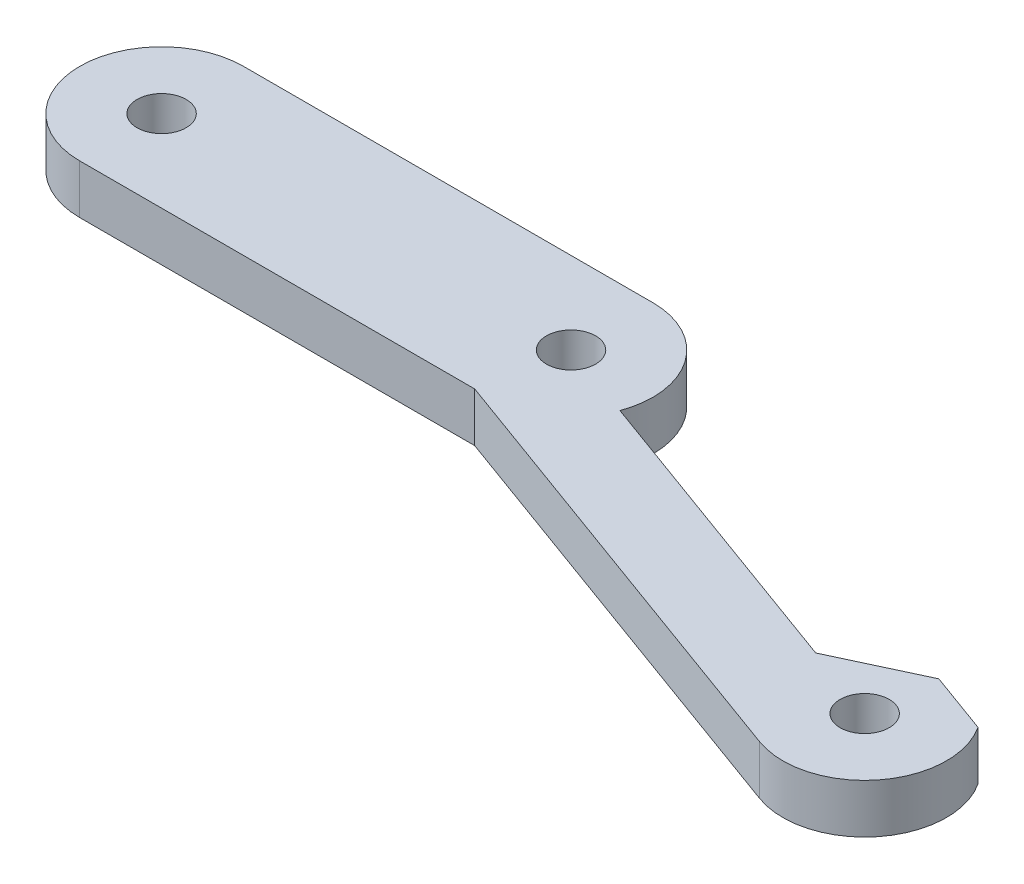
ISO-10303-21;
HEADER;
FILE_DESCRIPTION(('STEP AP214'),'2;1');
FILE_NAME('part.step','',(''),(''),'','','');
FILE_SCHEMA(('AUTOMOTIVE_DESIGN { 1 0 10303 214 1 1 1 1 }'));
ENDSEC;
DATA;
#1=APPLICATION_CONTEXT('core data for automotive mechanical design processes');
#2=APPLICATION_PROTOCOL_DEFINITION('international standard','automotive_design',2000,#1);
#3=PRODUCT_CONTEXT('',#1,'mechanical');
#4=PRODUCT('Part','Part','',(#3));
#5=PRODUCT_RELATED_PRODUCT_CATEGORY('part','',(#4));
#6=PRODUCT_DEFINITION_FORMATION('','',#4);
#7=PRODUCT_DEFINITION_CONTEXT('part definition',#1,'design');
#8=PRODUCT_DEFINITION('design','',#6,#7);
#9=PRODUCT_DEFINITION_SHAPE('','',#8);
#10=(LENGTH_UNIT() NAMED_UNIT(*) SI_UNIT(.MILLI.,.METRE.));
#11=(NAMED_UNIT(*) PLANE_ANGLE_UNIT() SI_UNIT($,.RADIAN.));
#12=(NAMED_UNIT(*) SI_UNIT($,.STERADIAN.) SOLID_ANGLE_UNIT());
#13=UNCERTAINTY_MEASURE_WITH_UNIT(LENGTH_MEASURE(1.E-05),#10,'distance_accuracy_value','');
#14=(GEOMETRIC_REPRESENTATION_CONTEXT(3) GLOBAL_UNCERTAINTY_ASSIGNED_CONTEXT((#13)) GLOBAL_UNIT_ASSIGNED_CONTEXT((#10,
#11,#12)) REPRESENTATION_CONTEXT('',''));
#15=CARTESIAN_POINT('',(0.,0.,0.));
#16=DIRECTION('',(0.,0.,1.));
#17=DIRECTION('',(1.,0.,0.));
#18=AXIS2_PLACEMENT_3D('',#15,#16,#17);
#19=CARTESIAN_POINT('',(53.1907786235772,3.,10.2606042997701));
#20=DIRECTION('',(0.,-1.,0.));
#21=DIRECTION('',(0.,0.,-1.));
#22=AXIS2_PLACEMENT_3D('',#19,#20,#21);
#23=CYLINDRICAL_SURFACE('',#22,5.);
#24=DIRECTION('',(0.,1.,0.));
#25=VECTOR('',#24,1.);
#26=CARTESIAN_POINT('',(57.3779370592376,-7.,7.52789424660347));
#27=LINE('',#26,#25);
#28=CARTESIAN_POINT('',(57.3779370592376,0.,7.52789424660347));
#29=VERTEX_POINT('',#28);
#30=CARTESIAN_POINT('',(57.3779370592376,3.,7.52789424660347));
#31=VERTEX_POINT('',#30);
#32=EDGE_CURVE('E240',#29,#31,#27,.T.);
#33=ORIENTED_EDGE('',*,*,#32,.T.);
#34=CARTESIAN_POINT('',(53.1907786235772,3.,10.2606042997701));
#35=DIRECTION('',(0.,1.,0.));
#36=DIRECTION('',(0.,0.,1.));
#37=AXIS2_PLACEMENT_3D('',#34,#35,#36);
#38=CIRCLE('',#37,5.);
#39=CARTESIAN_POINT('',(51.4806779069489,3.,14.9590674036996));
#40=VERTEX_POINT('',#39);
#41=EDGE_CURVE('E197',#40,#31,#38,.T.);
#42=ORIENTED_EDGE('',*,*,#41,.F.);
#43=DIRECTION('',(0.,-1.,0.));
#44=VECTOR('',#43,1.);
#45=CARTESIAN_POINT('',(51.4806779069489,3.,14.9590674036996));
#46=LINE('',#45,#44);
#47=CARTESIAN_POINT('',(51.4806779069489,0.,14.9590674036996));
#48=VERTEX_POINT('',#47);
#49=EDGE_CURVE('E12',#40,#48,#46,.T.);
#50=ORIENTED_EDGE('',*,*,#49,.T.);
#51=CARTESIAN_POINT('',(53.1907786235772,0.,10.2606042997701));
#52=DIRECTION('',(0.,1.,0.));
#53=DIRECTION('',(0.,0.,1.));
#54=AXIS2_PLACEMENT_3D('',#51,#52,#53);
#55=CIRCLE('',#54,5.);
#56=EDGE_CURVE('E194',#48,#29,#55,.T.);
#57=ORIENTED_EDGE('',*,*,#56,.T.);
#58=EDGE_LOOP('',(#33,#42,#50,#57));
#59=FACE_BOUND('',#58,.T.);
#60=ADVANCED_FACE('F107',(#59),#23,.T.);
#61=CARTESIAN_POINT('',(0.,0.,0.));
#62=DIRECTION('',(0.,1.,0.));
#63=DIRECTION('',(0.,0.,1.));
#64=AXIS2_PLACEMENT_3D('',#61,#62,#63);
#65=PLANE('',#64);
#66=CARTESIAN_POINT('',(0.,0.,0.));
#67=DIRECTION('',(0.,1.,0.));
#68=DIRECTION('',(0.,0.,1.));
#69=AXIS2_PLACEMENT_3D('',#66,#67,#68);
#70=CIRCLE('',#69,1.5);
#71=CARTESIAN_POINT('',(0.,0.,1.5));
#72=VERTEX_POINT('',#71);
#73=EDGE_CURVE('E208',#72,#72,#70,.T.);
#74=ORIENTED_EDGE('',*,*,#73,.T.);
#75=EDGE_LOOP('',(#74));
#76=FACE_BOUND('',#75,.T.);
#77=CARTESIAN_POINT('',(25.,0.,0.));
#78=DIRECTION('',(0.,1.,0.));
#79=DIRECTION('',(0.,0.,1.));
#80=AXIS2_PLACEMENT_3D('',#77,#78,#79);
#81=CIRCLE('',#80,1.5);
#82=CARTESIAN_POINT('',(25.,0.,1.5));
#83=VERTEX_POINT('',#82);
#84=EDGE_CURVE('E207',#83,#83,#81,.T.);
#85=ORIENTED_EDGE('',*,*,#84,.T.);
#86=EDGE_LOOP('',(#85));
#87=FACE_BOUND('',#86,.T.);
#88=CARTESIAN_POINT('',(53.1907786235772,0.,10.2606042997701));
#89=DIRECTION('',(0.,1.,0.));
#90=DIRECTION('',(0.,0.,1.));
#91=AXIS2_PLACEMENT_3D('',#88,#89,#90);
#92=CIRCLE('',#91,1.5);
#93=CARTESIAN_POINT('',(53.1907786235772,0.,11.7606042997701));
#94=VERTEX_POINT('',#93);
#95=EDGE_CURVE('E187',#94,#94,#92,.T.);
#96=ORIENTED_EDGE('',*,*,#95,.T.);
#97=EDGE_LOOP('',(#96));
#98=FACE_BOUND('',#97,.T.);
#99=CARTESIAN_POINT('',(25.,0.,0.));
#100=DIRECTION('',(0.,1.,0.));
#101=DIRECTION('',(0.,0.,1.));
#102=AXIS2_PLACEMENT_3D('',#99,#100,#101);
#103=CIRCLE('',#102,5.);
#104=CARTESIAN_POINT('',(29.6984631039295,0.,1.71010071662835));
#105=VERTEX_POINT('',#104);
#106=CARTESIAN_POINT('',(25.,0.,-5.));
#107=VERTEX_POINT('',#106);
#108=EDGE_CURVE('E153',#105,#107,#103,.T.);
#109=ORIENTED_EDGE('',*,*,#108,.F.);
#110=DIRECTION('',(-0.939692620785908,0.,-0.34202014332567));
#111=VECTOR('',#110,1.);
#112=CARTESIAN_POINT('',(2.92444446101279,0.,-8.03484512108176));
#113=LINE('',#112,#111);
#114=CARTESIAN_POINT('',(48.4923155196477,0.,8.55050358314173));
#115=VERTEX_POINT('',#114);
#116=EDGE_CURVE('E237',#115,#105,#113,.T.);
#117=ORIENTED_EDGE('',*,*,#116,.F.);
#118=DIRECTION('',(0.906307787036653,0.,-0.422618261740694));
#119=VECTOR('',#118,1.);
#120=CARTESIAN_POINT('',(11.936060847171,0.,25.5969650903818));
#121=LINE('',#120,#119);
#122=CARTESIAN_POINT('',(53.619166576094,0.,6.1598136733008));
#123=VERTEX_POINT('',#122);
#124=EDGE_CURVE('E234',#115,#123,#121,.T.);
#125=ORIENTED_EDGE('',*,*,#124,.T.);
#126=DIRECTION('',(-0.939692620785908,0.,-0.34202014332567));
#127=VECTOR('',#126,1.);
#128=CARTESIAN_POINT('',(4.29252503431547,0.,-11.7936156042254));
#129=LINE('',#128,#127);
#130=EDGE_CURVE('E211',#29,#123,#129,.T.);
#131=ORIENTED_EDGE('',*,*,#130,.F.);
#132=ORIENTED_EDGE('',*,*,#56,.F.);
#133=DIRECTION('',(0.939692620785908,0.,0.34202014332567));
#134=VECTOR('',#133,1.);
#135=CARTESIAN_POINT('',(1.21434374438445,0.,-3.33638201715223));
#136=LINE('',#135,#134);
#137=CARTESIAN_POINT('',(24.1183650964577,0.,5.));
#138=VERTEX_POINT('',#137);
#139=EDGE_CURVE('E189',#138,#48,#136,.T.);
#140=ORIENTED_EDGE('',*,*,#139,.F.);
#141=DIRECTION('',(1.,0.,0.));
#142=VECTOR('',#141,1.);
#143=CARTESIAN_POINT('',(0.,0.,5.));
#144=LINE('',#143,#142);
#145=CARTESIAN_POINT('',(0.,0.,5.));
#146=VERTEX_POINT('',#145);
#147=EDGE_CURVE('E177',#146,#138,#144,.T.);
#148=ORIENTED_EDGE('',*,*,#147,.F.);
#149=CARTESIAN_POINT('',(0.,0.,0.));
#150=DIRECTION('',(0.,1.,0.));
#151=DIRECTION('',(0.,0.,1.));
#152=AXIS2_PLACEMENT_3D('',#149,#150,#151);
#153=CIRCLE('',#152,5.);
#154=CARTESIAN_POINT('',(0.,0.,-5.));
#155=VERTEX_POINT('',#154);
#156=EDGE_CURVE('E162',#155,#146,#153,.T.);
#157=ORIENTED_EDGE('',*,*,#156,.F.);
#158=DIRECTION('',(1.,0.,0.));
#159=VECTOR('',#158,1.);
#160=CARTESIAN_POINT('',(0.,0.,-5.));
#161=LINE('',#160,#159);
#162=EDGE_CURVE('E175',#155,#107,#161,.T.);
#163=ORIENTED_EDGE('',*,*,#162,.T.);
#164=EDGE_LOOP('',(#109,#117,#125,#131,#132,#140,#148,#157,#163));
#165=FACE_BOUND('',#164,.T.);
#166=ADVANCED_FACE('F174',(#76,#87,#98,#165),#65,.F.);
#167=CARTESIAN_POINT('',(0.,3.,0.));
#168=DIRECTION('',(0.,1.,0.));
#169=DIRECTION('',(0.,0.,1.));
#170=AXIS2_PLACEMENT_3D('',#167,#168,#169);
#171=PLANE('',#170);
#172=CARTESIAN_POINT('',(53.1907786235772,3.,10.2606042997701));
#173=DIRECTION('',(0.,1.,0.));
#174=DIRECTION('',(0.,0.,1.));
#175=AXIS2_PLACEMENT_3D('',#172,#173,#174);
#176=CIRCLE('',#175,1.5);
#177=CARTESIAN_POINT('',(53.1907786235772,3.,11.7606042997701));
#178=VERTEX_POINT('',#177);
#179=EDGE_CURVE('E202',#178,#178,#176,.T.);
#180=ORIENTED_EDGE('',*,*,#179,.F.);
#181=EDGE_LOOP('',(#180));
#182=FACE_BOUND('',#181,.T.);
#183=CARTESIAN_POINT('',(25.,3.,0.));
#184=DIRECTION('',(0.,1.,0.));
#185=DIRECTION('',(0.,0.,1.));
#186=AXIS2_PLACEMENT_3D('',#183,#184,#185);
#187=CIRCLE('',#186,1.5);
#188=CARTESIAN_POINT('',(25.,3.,1.5));
#189=VERTEX_POINT('',#188);
#190=EDGE_CURVE('E179',#189,#189,#187,.T.);
#191=ORIENTED_EDGE('',*,*,#190,.F.);
#192=EDGE_LOOP('',(#191));
#193=FACE_BOUND('',#192,.T.);
#194=CARTESIAN_POINT('',(0.,3.,0.));
#195=DIRECTION('',(0.,1.,0.));
#196=DIRECTION('',(0.,0.,1.));
#197=AXIS2_PLACEMENT_3D('',#194,#195,#196);
#198=CIRCLE('',#197,1.5);
#199=CARTESIAN_POINT('',(0.,3.,1.5));
#200=VERTEX_POINT('',#199);
#201=EDGE_CURVE('E204',#200,#200,#198,.T.);
#202=ORIENTED_EDGE('',*,*,#201,.F.);
#203=EDGE_LOOP('',(#202));
#204=FACE_BOUND('',#203,.T.);
#205=DIRECTION('',(-0.939692620785908,0.,-0.34202014332567));
#206=VECTOR('',#205,1.);
#207=CARTESIAN_POINT('',(2.92444446101279,3.,-8.03484512108176));
#208=LINE('',#207,#206);
#209=CARTESIAN_POINT('',(48.4923155196477,3.,8.55050358314173));
#210=VERTEX_POINT('',#209);
#211=CARTESIAN_POINT('',(29.6984631039295,3.,1.71010071662835));
#212=VERTEX_POINT('',#211);
#213=EDGE_CURVE('E258',#210,#212,#208,.T.);
#214=ORIENTED_EDGE('',*,*,#213,.T.);
#215=CARTESIAN_POINT('',(25.,3.,0.));
#216=DIRECTION('',(0.,1.,0.));
#217=DIRECTION('',(0.,0.,1.));
#218=AXIS2_PLACEMENT_3D('',#215,#216,#217);
#219=CIRCLE('',#218,5.);
#220=CARTESIAN_POINT('',(25.,3.,-5.));
#221=VERTEX_POINT('',#220);
#222=EDGE_CURVE('E217',#212,#221,#219,.T.);
#223=ORIENTED_EDGE('',*,*,#222,.T.);
#224=DIRECTION('',(1.,0.,0.));
#225=VECTOR('',#224,1.);
#226=CARTESIAN_POINT('',(0.,3.,-5.));
#227=LINE('',#226,#225);
#228=CARTESIAN_POINT('',(0.,3.,-5.));
#229=VERTEX_POINT('',#228);
#230=EDGE_CURVE('E170',#229,#221,#227,.T.);
#231=ORIENTED_EDGE('',*,*,#230,.F.);
#232=CARTESIAN_POINT('',(0.,3.,0.));
#233=DIRECTION('',(0.,1.,0.));
#234=DIRECTION('',(0.,0.,1.));
#235=AXIS2_PLACEMENT_3D('',#232,#233,#234);
#236=CIRCLE('',#235,5.);
#237=CARTESIAN_POINT('',(0.,3.,5.));
#238=VERTEX_POINT('',#237);
#239=EDGE_CURVE('E164',#229,#238,#236,.T.);
#240=ORIENTED_EDGE('',*,*,#239,.T.);
#241=DIRECTION('',(1.,0.,0.));
#242=VECTOR('',#241,1.);
#243=CARTESIAN_POINT('',(0.,3.,5.));
#244=LINE('',#243,#242);
#245=CARTESIAN_POINT('',(24.1183650964577,3.,5.));
#246=VERTEX_POINT('',#245);
#247=EDGE_CURVE('E183',#238,#246,#244,.T.);
#248=ORIENTED_EDGE('',*,*,#247,.T.);
#249=DIRECTION('',(0.939692620785908,0.,0.34202014332567));
#250=VECTOR('',#249,1.);
#251=CARTESIAN_POINT('',(1.21434374438445,3.,-3.33638201715223));
#252=LINE('',#251,#250);
#253=EDGE_CURVE('E226',#246,#40,#252,.T.);
#254=ORIENTED_EDGE('',*,*,#253,.T.);
#255=ORIENTED_EDGE('',*,*,#41,.T.);
#256=DIRECTION('',(-0.939692620785908,0.,-0.34202014332567));
#257=VECTOR('',#256,1.);
#258=CARTESIAN_POINT('',(4.29252503431547,3.,-11.7936156042254));
#259=LINE('',#258,#257);
#260=CARTESIAN_POINT('',(53.619166576094,3.,6.1598136733008));
#261=VERTEX_POINT('',#260);
#262=EDGE_CURVE('E245',#31,#261,#259,.T.);
#263=ORIENTED_EDGE('',*,*,#262,.T.);
#264=DIRECTION('',(0.906307787036653,0.,-0.422618261740694));
#265=VECTOR('',#264,1.);
#266=CARTESIAN_POINT('',(11.936060847171,3.,25.5969650903818));
#267=LINE('',#266,#265);
#268=EDGE_CURVE('E255',#210,#261,#267,.T.);
#269=ORIENTED_EDGE('',*,*,#268,.F.);
#270=EDGE_LOOP('',(#214,#223,#231,#240,#248,#254,#255,#263,#269));
#271=FACE_BOUND('',#270,.T.);
#272=ADVANCED_FACE('F263',(#182,#193,#204,#271),#171,.T.);
#273=CARTESIAN_POINT('',(1.21434374438445,3.,-3.33638201715223));
#274=DIRECTION('',(0.34202014332567,0.,-0.939692620785908));
#275=DIRECTION('',(-0.939692620785908,0.,-0.34202014332567));
#276=AXIS2_PLACEMENT_3D('',#273,#274,#275);
#277=PLANE('',#276);
#278=ORIENTED_EDGE('',*,*,#139,.T.);
#279=ORIENTED_EDGE('',*,*,#49,.F.);
#280=ORIENTED_EDGE('',*,*,#253,.F.);
#281=DIRECTION('',(0.,-1.,0.));
#282=VECTOR('',#281,1.);
#283=CARTESIAN_POINT('',(24.1183650964577,3.,5.));
#284=LINE('',#283,#282);
#285=EDGE_CURVE('E117',#246,#138,#284,.T.);
#286=ORIENTED_EDGE('',*,*,#285,.T.);
#287=EDGE_LOOP('',(#278,#279,#280,#286));
#288=FACE_BOUND('',#287,.T.);
#289=ADVANCED_FACE('F223',(#288),#277,.F.);
#290=CARTESIAN_POINT('',(53.1907786235772,3.,10.2606042997701));
#291=DIRECTION('',(0.,-1.,0.));
#292=DIRECTION('',(0.,0.,-1.));
#293=AXIS2_PLACEMENT_3D('',#290,#291,#292);
#294=CYLINDRICAL_SURFACE('',#293,1.5);
#295=ORIENTED_EDGE('',*,*,#179,.T.);
#296=EDGE_LOOP('',(#295));
#297=FACE_BOUND('',#296,.T.);
#298=ORIENTED_EDGE('',*,*,#95,.F.);
#299=EDGE_LOOP('',(#298));
#300=FACE_BOUND('',#299,.T.);
#301=ADVANCED_FACE('F301',(#297,#300),#294,.F.);
#302=CARTESIAN_POINT('',(0.,3.,0.));
#303=DIRECTION('',(0.,-1.,0.));
#304=DIRECTION('',(0.,0.,-1.));
#305=AXIS2_PLACEMENT_3D('',#302,#303,#304);
#306=CYLINDRICAL_SURFACE('',#305,1.5);
#307=ORIENTED_EDGE('',*,*,#201,.T.);
#308=EDGE_LOOP('',(#307));
#309=FACE_BOUND('',#308,.T.);
#310=ORIENTED_EDGE('',*,*,#73,.F.);
#311=EDGE_LOOP('',(#310));
#312=FACE_BOUND('',#311,.T.);
#313=ADVANCED_FACE('F304',(#309,#312),#306,.F.);
#314=CARTESIAN_POINT('',(25.,3.,0.));
#315=DIRECTION('',(0.,-1.,0.));
#316=DIRECTION('',(0.,0.,-1.));
#317=AXIS2_PLACEMENT_3D('',#314,#315,#316);
#318=CYLINDRICAL_SURFACE('',#317,1.5);
#319=ORIENTED_EDGE('',*,*,#190,.T.);
#320=EDGE_LOOP('',(#319));
#321=FACE_BOUND('',#320,.T.);
#322=ORIENTED_EDGE('',*,*,#84,.F.);
#323=EDGE_LOOP('',(#322));
#324=FACE_BOUND('',#323,.T.);
#325=ADVANCED_FACE('F308',(#321,#324),#318,.F.);
#326=CARTESIAN_POINT('',(0.,3.,5.));
#327=DIRECTION('',(0.,0.,-1.));
#328=DIRECTION('',(-1.,0.,0.));
#329=AXIS2_PLACEMENT_3D('',#326,#327,#328);
#330=PLANE('',#329);
#331=ORIENTED_EDGE('',*,*,#147,.T.);
#332=ORIENTED_EDGE('',*,*,#285,.F.);
#333=ORIENTED_EDGE('',*,*,#247,.F.);
#334=DIRECTION('',(0.,-1.,0.));
#335=VECTOR('',#334,1.);
#336=CARTESIAN_POINT('',(0.,3.,5.));
#337=LINE('',#336,#335);
#338=EDGE_CURVE('E111',#238,#146,#337,.T.);
#339=ORIENTED_EDGE('',*,*,#338,.T.);
#340=EDGE_LOOP('',(#331,#332,#333,#339));
#341=FACE_BOUND('',#340,.T.);
#342=ADVANCED_FACE('F219',(#341),#330,.F.);
#343=CARTESIAN_POINT('',(25.,3.,0.));
#344=DIRECTION('',(0.,-1.,0.));
#345=DIRECTION('',(0.,0.,-1.));
#346=AXIS2_PLACEMENT_3D('',#343,#344,#345);
#347=CYLINDRICAL_SURFACE('',#346,5.);
#348=ORIENTED_EDGE('',*,*,#222,.F.);
#349=DIRECTION('',(0.,1.,0.));
#350=VECTOR('',#349,1.);
#351=CARTESIAN_POINT('',(29.6984631039295,-7.,1.71010071662835));
#352=LINE('',#351,#350);
#353=EDGE_CURVE('E241',#105,#212,#352,.T.);
#354=ORIENTED_EDGE('',*,*,#353,.F.);
#355=ORIENTED_EDGE('',*,*,#108,.T.);
#356=DIRECTION('',(0.,-1.,0.));
#357=VECTOR('',#356,1.);
#358=CARTESIAN_POINT('',(25.,3.,-5.));
#359=LINE('',#358,#357);
#360=EDGE_CURVE('E169',#221,#107,#359,.T.);
#361=ORIENTED_EDGE('',*,*,#360,.F.);
#362=EDGE_LOOP('',(#348,#354,#355,#361));
#363=FACE_BOUND('',#362,.T.);
#364=ADVANCED_FACE('F315',(#363),#347,.T.);
#365=CARTESIAN_POINT('',(0.,3.,-5.));
#366=DIRECTION('',(0.,0.,-1.));
#367=DIRECTION('',(-1.,0.,0.));
#368=AXIS2_PLACEMENT_3D('',#365,#366,#367);
#369=PLANE('',#368);
#370=ORIENTED_EDGE('',*,*,#162,.F.);
#371=DIRECTION('',(0.,-1.,0.));
#372=VECTOR('',#371,1.);
#373=CARTESIAN_POINT('',(0.,3.,-5.));
#374=LINE('',#373,#372);
#375=EDGE_CURVE('E159',#229,#155,#374,.T.);
#376=ORIENTED_EDGE('',*,*,#375,.F.);
#377=ORIENTED_EDGE('',*,*,#230,.T.);
#378=ORIENTED_EDGE('',*,*,#360,.T.);
#379=EDGE_LOOP('',(#370,#376,#377,#378));
#380=FACE_BOUND('',#379,.T.);
#381=ADVANCED_FACE('F181',(#380),#369,.T.);
#382=CARTESIAN_POINT('',(0.,3.,0.));
#383=DIRECTION('',(0.,-1.,0.));
#384=DIRECTION('',(0.,0.,-1.));
#385=AXIS2_PLACEMENT_3D('',#382,#383,#384);
#386=CYLINDRICAL_SURFACE('',#385,5.);
#387=ORIENTED_EDGE('',*,*,#156,.T.);
#388=ORIENTED_EDGE('',*,*,#338,.F.);
#389=ORIENTED_EDGE('',*,*,#239,.F.);
#390=ORIENTED_EDGE('',*,*,#375,.T.);
#391=EDGE_LOOP('',(#387,#388,#389,#390));
#392=FACE_BOUND('',#391,.T.);
#393=ADVANCED_FACE('F109',(#392),#386,.T.);
#394=CARTESIAN_POINT('',(4.29252503431547,-7.,-11.7936156042254));
#395=DIRECTION('',(0.34202014332567,0.,-0.939692620785908));
#396=DIRECTION('',(-0.939692620785908,0.,-0.34202014332567));
#397=AXIS2_PLACEMENT_3D('',#394,#395,#396);
#398=PLANE('',#397);
#399=ORIENTED_EDGE('',*,*,#130,.T.);
#400=DIRECTION('',(0.,1.,0.));
#401=VECTOR('',#400,1.);
#402=CARTESIAN_POINT('',(53.619166576094,-7.,6.1598136733008));
#403=LINE('',#402,#401);
#404=EDGE_CURVE('E248',#123,#261,#403,.T.);
#405=ORIENTED_EDGE('',*,*,#404,.T.);
#406=ORIENTED_EDGE('',*,*,#262,.F.);
#407=ORIENTED_EDGE('',*,*,#32,.F.);
#408=EDGE_LOOP('',(#399,#405,#406,#407));
#409=FACE_BOUND('',#408,.T.);
#410=ADVANCED_FACE('F287',(#409),#398,.T.);
#411=CARTESIAN_POINT('',(11.936060847171,-7.,25.5969650903818));
#412=DIRECTION('',(0.422618261740694,0.,0.906307787036653));
#413=DIRECTION('',(0.906307787036653,0.,-0.422618261740694));
#414=AXIS2_PLACEMENT_3D('',#411,#412,#413);
#415=PLANE('',#414);
#416=DIRECTION('',(0.,1.,0.));
#417=VECTOR('',#416,1.);
#418=CARTESIAN_POINT('',(48.4923155196477,-7.,8.55050358314173));
#419=LINE('',#418,#417);
#420=EDGE_CURVE('E244',#115,#210,#419,.T.);
#421=ORIENTED_EDGE('',*,*,#420,.T.);
#422=ORIENTED_EDGE('',*,*,#268,.T.);
#423=ORIENTED_EDGE('',*,*,#404,.F.);
#424=ORIENTED_EDGE('',*,*,#124,.F.);
#425=EDGE_LOOP('',(#421,#422,#423,#424));
#426=FACE_BOUND('',#425,.T.);
#427=ADVANCED_FACE('F342',(#426),#415,.F.);
#428=CARTESIAN_POINT('',(2.92444446101279,-7.,-8.03484512108176));
#429=DIRECTION('',(0.34202014332567,0.,-0.939692620785908));
#430=DIRECTION('',(-0.939692620785908,0.,-0.34202014332567));
#431=AXIS2_PLACEMENT_3D('',#428,#429,#430);
#432=PLANE('',#431);
#433=ORIENTED_EDGE('',*,*,#116,.T.);
#434=ORIENTED_EDGE('',*,*,#353,.T.);
#435=ORIENTED_EDGE('',*,*,#213,.F.);
#436=ORIENTED_EDGE('',*,*,#420,.F.);
#437=EDGE_LOOP('',(#433,#434,#435,#436));
#438=FACE_BOUND('',#437,.T.);
#439=ADVANCED_FACE('F269',(#438),#432,.T.);
#440=CLOSED_SHELL('',(#60,#166,#272,#289,#301,#313,#325,#342,#364,#381,#393,#410,#427,#439));
#441=MANIFOLD_SOLID_BREP('B2',#440);
#442=ADVANCED_BREP_SHAPE_REPRESENTATION('',(#18,#441),#14);
#443=SHAPE_DEFINITION_REPRESENTATION(#9,#442);
ENDSEC;
END-ISO-10303-21;
